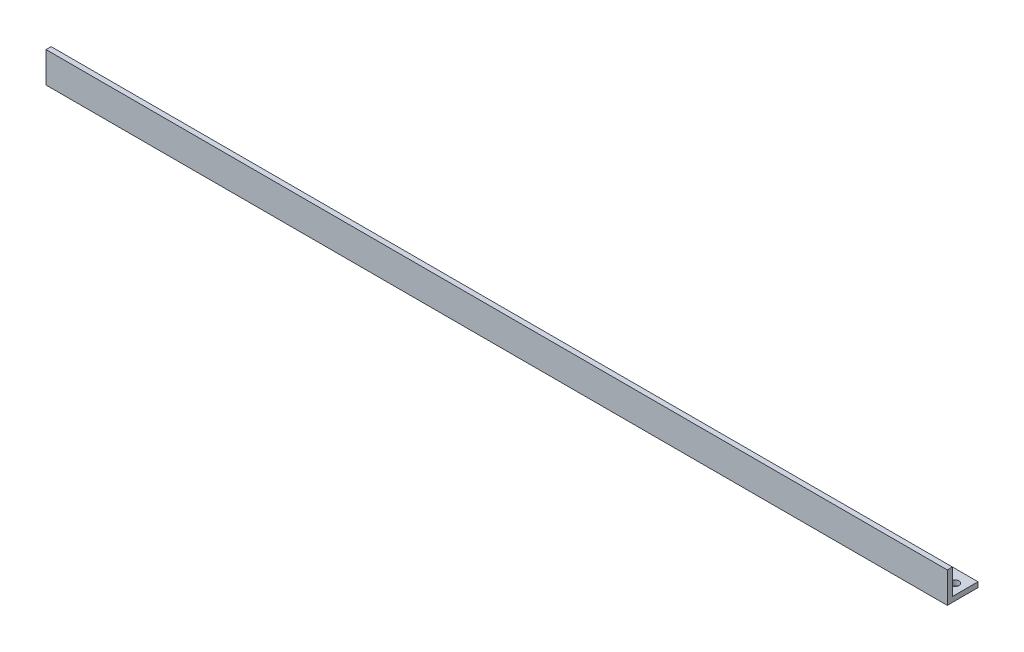
ISO-10303-21;
HEADER;
FILE_DESCRIPTION(('STEP AP214'),'2;1');
FILE_NAME('part.step','',(''),(''),'','','');
FILE_SCHEMA(('AUTOMOTIVE_DESIGN { 1 0 10303 214 1 1 1 1 }'));
ENDSEC;
DATA;
#1=APPLICATION_CONTEXT('core data for automotive mechanical design processes');
#2=APPLICATION_PROTOCOL_DEFINITION('international standard','automotive_design',2000,#1);
#3=PRODUCT_CONTEXT('',#1,'mechanical');
#4=PRODUCT('Part','Part','',(#3));
#5=PRODUCT_RELATED_PRODUCT_CATEGORY('part','',(#4));
#6=PRODUCT_DEFINITION_FORMATION('','',#4);
#7=PRODUCT_DEFINITION_CONTEXT('part definition',#1,'design');
#8=PRODUCT_DEFINITION('design','',#6,#7);
#9=PRODUCT_DEFINITION_SHAPE('','',#8);
#10=(LENGTH_UNIT() NAMED_UNIT(*) SI_UNIT(.MILLI.,.METRE.));
#11=(NAMED_UNIT(*) PLANE_ANGLE_UNIT() SI_UNIT($,.RADIAN.));
#12=(NAMED_UNIT(*) SI_UNIT($,.STERADIAN.) SOLID_ANGLE_UNIT());
#13=UNCERTAINTY_MEASURE_WITH_UNIT(LENGTH_MEASURE(1.E-05),#10,'distance_accuracy_value','');
#14=(GEOMETRIC_REPRESENTATION_CONTEXT(3) GLOBAL_UNCERTAINTY_ASSIGNED_CONTEXT((#13)) GLOBAL_UNIT_ASSIGNED_CONTEXT((#10,
#11,#12)) REPRESENTATION_CONTEXT('',''));
#15=CARTESIAN_POINT('',(0.,0.,0.));
#16=DIRECTION('',(0.,0.,1.));
#17=DIRECTION('',(1.,0.,0.));
#18=AXIS2_PLACEMENT_3D('',#15,#16,#17);
#19=CARTESIAN_POINT('',(558.8,0.,0.));
#20=DIRECTION('',(0.,0.,-1.));
#21=DIRECTION('',(-1.,0.,0.));
#22=AXIS2_PLACEMENT_3D('',#19,#20,#21);
#23=PLANE('',#22);
#24=DIRECTION('',(0.,-1.,0.));
#25=VECTOR('',#24,1.);
#26=CARTESIAN_POINT('',(0.,0.,0.));
#27=LINE('',#26,#25);
#28=CARTESIAN_POINT('',(0.,19.05,0.));
#29=VERTEX_POINT('',#28);
#30=CARTESIAN_POINT('',(0.,0.,0.));
#31=VERTEX_POINT('',#30);
#32=EDGE_CURVE('E117',#29,#31,#27,.T.);
#33=ORIENTED_EDGE('',*,*,#32,.T.);
#34=DIRECTION('',(-1.,0.,0.));
#35=VECTOR('',#34,1.);
#36=CARTESIAN_POINT('',(558.8,0.,0.));
#37=LINE('',#36,#35);
#38=CARTESIAN_POINT('',(558.8,0.,0.));
#39=VERTEX_POINT('',#38);
#40=EDGE_CURVE('E11',#39,#31,#37,.T.);
#41=ORIENTED_EDGE('',*,*,#40,.F.);
#42=DIRECTION('',(0.,-1.,0.));
#43=VECTOR('',#42,1.);
#44=CARTESIAN_POINT('',(558.8,0.,0.));
#45=LINE('',#44,#43);
#46=CARTESIAN_POINT('',(558.8,19.05,0.));
#47=VERTEX_POINT('',#46);
#48=EDGE_CURVE('E128',#47,#39,#45,.T.);
#49=ORIENTED_EDGE('',*,*,#48,.F.);
#50=DIRECTION('',(-1.,0.,0.));
#51=VECTOR('',#50,1.);
#52=CARTESIAN_POINT('',(558.8,19.05,0.));
#53=LINE('',#52,#51);
#54=EDGE_CURVE('E113',#47,#29,#53,.T.);
#55=ORIENTED_EDGE('',*,*,#54,.T.);
#56=EDGE_LOOP('',(#33,#41,#49,#55));
#57=FACE_BOUND('',#56,.T.);
#58=ADVANCED_FACE('F33',(#57),#23,.F.);
#59=CARTESIAN_POINT('',(558.8,0.,0.));
#60=DIRECTION('',(0.,1.,0.));
#61=DIRECTION('',(0.,0.,1.));
#62=AXIS2_PLACEMENT_3D('',#59,#60,#61);
#63=PLANE('',#62);
#64=CARTESIAN_POINT('',(552.45,0.,-11.1125));
#65=DIRECTION('',(0.,1.,0.));
#66=DIRECTION('',(0.,0.,1.));
#67=AXIS2_PLACEMENT_3D('',#64,#65,#66);
#68=CIRCLE('',#67,2.53999999999996);
#69=CARTESIAN_POINT('',(552.45,0.,-8.57250000000008));
#70=VERTEX_POINT('',#69);
#71=EDGE_CURVE('E121',#70,#70,#68,.F.);
#72=ORIENTED_EDGE('',*,*,#71,.F.);
#73=EDGE_LOOP('',(#72));
#74=FACE_BOUND('',#73,.T.);
#75=CARTESIAN_POINT('',(6.35000000000002,0.,-11.1125));
#76=DIRECTION('',(0.,1.,0.));
#77=DIRECTION('',(0.,0.,1.));
#78=AXIS2_PLACEMENT_3D('',#75,#76,#77);
#79=CIRCLE('',#78,2.54);
#80=CARTESIAN_POINT('',(6.35000000000002,0.,-8.5725));
#81=VERTEX_POINT('',#80);
#82=EDGE_CURVE('E176',#81,#81,#79,.F.);
#83=ORIENTED_EDGE('',*,*,#82,.F.);
#84=EDGE_LOOP('',(#83));
#85=FACE_BOUND('',#84,.T.);
#86=DIRECTION('',(0.,0.,-1.));
#87=VECTOR('',#86,1.);
#88=CARTESIAN_POINT('',(0.,0.,0.));
#89=LINE('',#88,#87);
#90=CARTESIAN_POINT('',(0.,0.,-19.05));
#91=VERTEX_POINT('',#90);
#92=EDGE_CURVE('E120',#31,#91,#89,.T.);
#93=ORIENTED_EDGE('',*,*,#92,.T.);
#94=DIRECTION('',(-1.,0.,0.));
#95=VECTOR('',#94,1.);
#96=CARTESIAN_POINT('',(558.8,0.,-19.05));
#97=LINE('',#96,#95);
#98=CARTESIAN_POINT('',(558.8,0.,-19.05));
#99=VERTEX_POINT('',#98);
#100=EDGE_CURVE('E41',#99,#91,#97,.T.);
#101=ORIENTED_EDGE('',*,*,#100,.F.);
#102=DIRECTION('',(0.,0.,-1.));
#103=VECTOR('',#102,1.);
#104=CARTESIAN_POINT('',(558.8,0.,0.));
#105=LINE('',#104,#103);
#106=EDGE_CURVE('E86',#39,#99,#105,.T.);
#107=ORIENTED_EDGE('',*,*,#106,.F.);
#108=ORIENTED_EDGE('',*,*,#40,.T.);
#109=EDGE_LOOP('',(#93,#101,#107,#108));
#110=FACE_BOUND('',#109,.T.);
#111=ADVANCED_FACE('F152',(#74,#85,#110),#63,.F.);
#112=CARTESIAN_POINT('',(558.8,0.,-19.05));
#113=DIRECTION('',(0.,0.,1.));
#114=DIRECTION('',(1.,0.,0.));
#115=AXIS2_PLACEMENT_3D('',#112,#113,#114);
#116=PLANE('',#115);
#117=DIRECTION('',(0.,1.,0.));
#118=VECTOR('',#117,1.);
#119=CARTESIAN_POINT('',(0.,0.,-19.05));
#120=LINE('',#119,#118);
#121=CARTESIAN_POINT('',(0.,3.175,-19.05));
#122=VERTEX_POINT('',#121);
#123=EDGE_CURVE('E123',#91,#122,#120,.T.);
#124=ORIENTED_EDGE('',*,*,#123,.T.);
#125=DIRECTION('',(-1.,0.,0.));
#126=VECTOR('',#125,1.);
#127=CARTESIAN_POINT('',(558.8,3.175,-19.05));
#128=LINE('',#127,#126);
#129=CARTESIAN_POINT('',(558.8,3.175,-19.05));
#130=VERTEX_POINT('',#129);
#131=EDGE_CURVE('E108',#130,#122,#128,.T.);
#132=ORIENTED_EDGE('',*,*,#131,.F.);
#133=DIRECTION('',(0.,1.,0.));
#134=VECTOR('',#133,1.);
#135=CARTESIAN_POINT('',(558.8,0.,-19.05));
#136=LINE('',#135,#134);
#137=EDGE_CURVE('E99',#99,#130,#136,.T.);
#138=ORIENTED_EDGE('',*,*,#137,.F.);
#139=ORIENTED_EDGE('',*,*,#100,.T.);
#140=EDGE_LOOP('',(#124,#132,#138,#139));
#141=FACE_BOUND('',#140,.T.);
#142=ADVANCED_FACE('F134',(#141),#116,.F.);
#143=CARTESIAN_POINT('',(558.8,3.175,-3.175));
#144=DIRECTION('',(0.,-1.,0.));
#145=DIRECTION('',(0.,0.,-1.));
#146=AXIS2_PLACEMENT_3D('',#143,#144,#145);
#147=PLANE('',#146);
#148=CARTESIAN_POINT('',(552.45,3.175,-11.1125));
#149=DIRECTION('',(0.,1.,0.));
#150=DIRECTION('',(0.,0.,1.));
#151=AXIS2_PLACEMENT_3D('',#148,#149,#150);
#152=CIRCLE('',#151,2.53999999999996);
#153=CARTESIAN_POINT('',(552.45,3.175,-8.57250000000008));
#154=VERTEX_POINT('',#153);
#155=EDGE_CURVE('E171',#154,#154,#152,.T.);
#156=ORIENTED_EDGE('',*,*,#155,.F.);
#157=EDGE_LOOP('',(#156));
#158=FACE_BOUND('',#157,.T.);
#159=CARTESIAN_POINT('',(6.35000000000002,3.175,-11.1125));
#160=DIRECTION('',(0.,1.,0.));
#161=DIRECTION('',(0.,0.,1.));
#162=AXIS2_PLACEMENT_3D('',#159,#160,#161);
#163=CIRCLE('',#162,2.54);
#164=CARTESIAN_POINT('',(6.35000000000002,3.175,-8.5725));
#165=VERTEX_POINT('',#164);
#166=EDGE_CURVE('E174',#165,#165,#163,.T.);
#167=ORIENTED_EDGE('',*,*,#166,.F.);
#168=EDGE_LOOP('',(#167));
#169=FACE_BOUND('',#168,.T.);
#170=DIRECTION('',(0.,0.,1.));
#171=VECTOR('',#170,1.);
#172=CARTESIAN_POINT('',(0.,3.175,-3.175));
#173=LINE('',#172,#171);
#174=CARTESIAN_POINT('',(0.,3.175,-3.175));
#175=VERTEX_POINT('',#174);
#176=EDGE_CURVE('E107',#122,#175,#173,.T.);
#177=ORIENTED_EDGE('',*,*,#176,.T.);
#178=DIRECTION('',(-1.,0.,0.));
#179=VECTOR('',#178,1.);
#180=CARTESIAN_POINT('',(558.8,3.175,-3.175));
#181=LINE('',#180,#179);
#182=CARTESIAN_POINT('',(558.8,3.175,-3.175));
#183=VERTEX_POINT('',#182);
#184=EDGE_CURVE('E104',#183,#175,#181,.T.);
#185=ORIENTED_EDGE('',*,*,#184,.F.);
#186=DIRECTION('',(0.,0.,1.));
#187=VECTOR('',#186,1.);
#188=CARTESIAN_POINT('',(558.8,3.175,-3.175));
#189=LINE('',#188,#187);
#190=EDGE_CURVE('E93',#130,#183,#189,.T.);
#191=ORIENTED_EDGE('',*,*,#190,.F.);
#192=ORIENTED_EDGE('',*,*,#131,.T.);
#193=EDGE_LOOP('',(#177,#185,#191,#192));
#194=FACE_BOUND('',#193,.T.);
#195=ADVANCED_FACE('F105',(#158,#169,#194),#147,.F.);
#196=CARTESIAN_POINT('',(558.8,3.175,-3.175));
#197=DIRECTION('',(0.,0.,1.));
#198=DIRECTION('',(1.,0.,0.));
#199=AXIS2_PLACEMENT_3D('',#196,#197,#198);
#200=PLANE('',#199);
#201=DIRECTION('',(0.,1.,0.));
#202=VECTOR('',#201,1.);
#203=CARTESIAN_POINT('',(0.,3.175,-3.175));
#204=LINE('',#203,#202);
#205=CARTESIAN_POINT('',(0.,19.05,-3.175));
#206=VERTEX_POINT('',#205);
#207=EDGE_CURVE('E72',#175,#206,#204,.T.);
#208=ORIENTED_EDGE('',*,*,#207,.T.);
#209=DIRECTION('',(-1.,0.,0.));
#210=VECTOR('',#209,1.);
#211=CARTESIAN_POINT('',(558.8,19.05,-3.175));
#212=LINE('',#211,#210);
#213=CARTESIAN_POINT('',(558.8,19.05,-3.175));
#214=VERTEX_POINT('',#213);
#215=EDGE_CURVE('E109',#214,#206,#212,.T.);
#216=ORIENTED_EDGE('',*,*,#215,.F.);
#217=DIRECTION('',(0.,1.,0.));
#218=VECTOR('',#217,1.);
#219=CARTESIAN_POINT('',(558.8,3.175,-3.175));
#220=LINE('',#219,#218);
#221=EDGE_CURVE('E97',#183,#214,#220,.T.);
#222=ORIENTED_EDGE('',*,*,#221,.F.);
#223=ORIENTED_EDGE('',*,*,#184,.T.);
#224=EDGE_LOOP('',(#208,#216,#222,#223));
#225=FACE_BOUND('',#224,.T.);
#226=ADVANCED_FACE('F111',(#225),#200,.F.);
#227=CARTESIAN_POINT('',(558.8,19.05,0.));
#228=DIRECTION('',(0.,-1.,0.));
#229=DIRECTION('',(0.,0.,-1.));
#230=AXIS2_PLACEMENT_3D('',#227,#228,#229);
#231=PLANE('',#230);
#232=DIRECTION('',(0.,0.,1.));
#233=VECTOR('',#232,1.);
#234=CARTESIAN_POINT('',(0.,19.05,0.));
#235=LINE('',#234,#233);
#236=EDGE_CURVE('E78',#206,#29,#235,.T.);
#237=ORIENTED_EDGE('',*,*,#236,.T.);
#238=ORIENTED_EDGE('',*,*,#54,.F.);
#239=DIRECTION('',(0.,0.,1.));
#240=VECTOR('',#239,1.);
#241=CARTESIAN_POINT('',(558.8,19.05,0.));
#242=LINE('',#241,#240);
#243=EDGE_CURVE('E49',#214,#47,#242,.T.);
#244=ORIENTED_EDGE('',*,*,#243,.F.);
#245=ORIENTED_EDGE('',*,*,#215,.T.);
#246=EDGE_LOOP('',(#237,#238,#244,#245));
#247=FACE_BOUND('',#246,.T.);
#248=ADVANCED_FACE('F141',(#247),#231,.F.);
#249=CARTESIAN_POINT('',(558.8,0.,0.));
#250=DIRECTION('',(-1.,0.,0.));
#251=DIRECTION('',(0.,0.,1.));
#252=AXIS2_PLACEMENT_3D('',#249,#250,#251);
#253=PLANE('',#252);
#254=ORIENTED_EDGE('',*,*,#48,.T.);
#255=ORIENTED_EDGE('',*,*,#106,.T.);
#256=ORIENTED_EDGE('',*,*,#137,.T.);
#257=ORIENTED_EDGE('',*,*,#190,.T.);
#258=ORIENTED_EDGE('',*,*,#221,.T.);
#259=ORIENTED_EDGE('',*,*,#243,.T.);
#260=EDGE_LOOP('',(#254,#255,#256,#257,#258,#259));
#261=FACE_BOUND('',#260,.T.);
#262=ADVANCED_FACE('F95',(#261),#253,.F.);
#263=CARTESIAN_POINT('',(0.,0.,0.));
#264=DIRECTION('',(-1.,0.,0.));
#265=DIRECTION('',(0.,0.,1.));
#266=AXIS2_PLACEMENT_3D('',#263,#264,#265);
#267=PLANE('',#266);
#268=ORIENTED_EDGE('',*,*,#32,.F.);
#269=ORIENTED_EDGE('',*,*,#236,.F.);
#270=ORIENTED_EDGE('',*,*,#207,.F.);
#271=ORIENTED_EDGE('',*,*,#176,.F.);
#272=ORIENTED_EDGE('',*,*,#123,.F.);
#273=ORIENTED_EDGE('',*,*,#92,.F.);
#274=EDGE_LOOP('',(#268,#269,#270,#271,#272,#273));
#275=FACE_BOUND('',#274,.T.);
#276=ADVANCED_FACE('F137',(#275),#267,.T.);
#277=CARTESIAN_POINT('',(6.35000000000002,-0.00100000000000013,-11.1125));
#278=DIRECTION('',(0.,1.,0.));
#279=DIRECTION('',(0.,0.,1.));
#280=AXIS2_PLACEMENT_3D('',#277,#278,#279);
#281=CYLINDRICAL_SURFACE('',#280,2.54);
#282=ORIENTED_EDGE('',*,*,#166,.T.);
#283=EDGE_LOOP('',(#282));
#284=FACE_BOUND('',#283,.T.);
#285=ORIENTED_EDGE('',*,*,#82,.T.);
#286=EDGE_LOOP('',(#285));
#287=FACE_BOUND('',#286,.T.);
#288=ADVANCED_FACE('F189',(#284,#287),#281,.F.);
#289=CARTESIAN_POINT('',(552.45,-0.00100000000000013,-11.1125));
#290=DIRECTION('',(0.,1.,0.));
#291=DIRECTION('',(0.,0.,1.));
#292=AXIS2_PLACEMENT_3D('',#289,#290,#291);
#293=CYLINDRICAL_SURFACE('',#292,2.53999999999996);
#294=ORIENTED_EDGE('',*,*,#155,.T.);
#295=EDGE_LOOP('',(#294));
#296=FACE_BOUND('',#295,.T.);
#297=ORIENTED_EDGE('',*,*,#71,.T.);
#298=EDGE_LOOP('',(#297));
#299=FACE_BOUND('',#298,.T.);
#300=ADVANCED_FACE('F186',(#296,#299),#293,.F.);
#301=CLOSED_SHELL('',(#58,#111,#142,#195,#226,#248,#262,#276,#288,#300));
#302=MANIFOLD_SOLID_BREP('B2',#301);
#303=ADVANCED_BREP_SHAPE_REPRESENTATION('',(#18,#302),#14);
#304=SHAPE_DEFINITION_REPRESENTATION(#9,#303);
ENDSEC;
END-ISO-10303-21;
